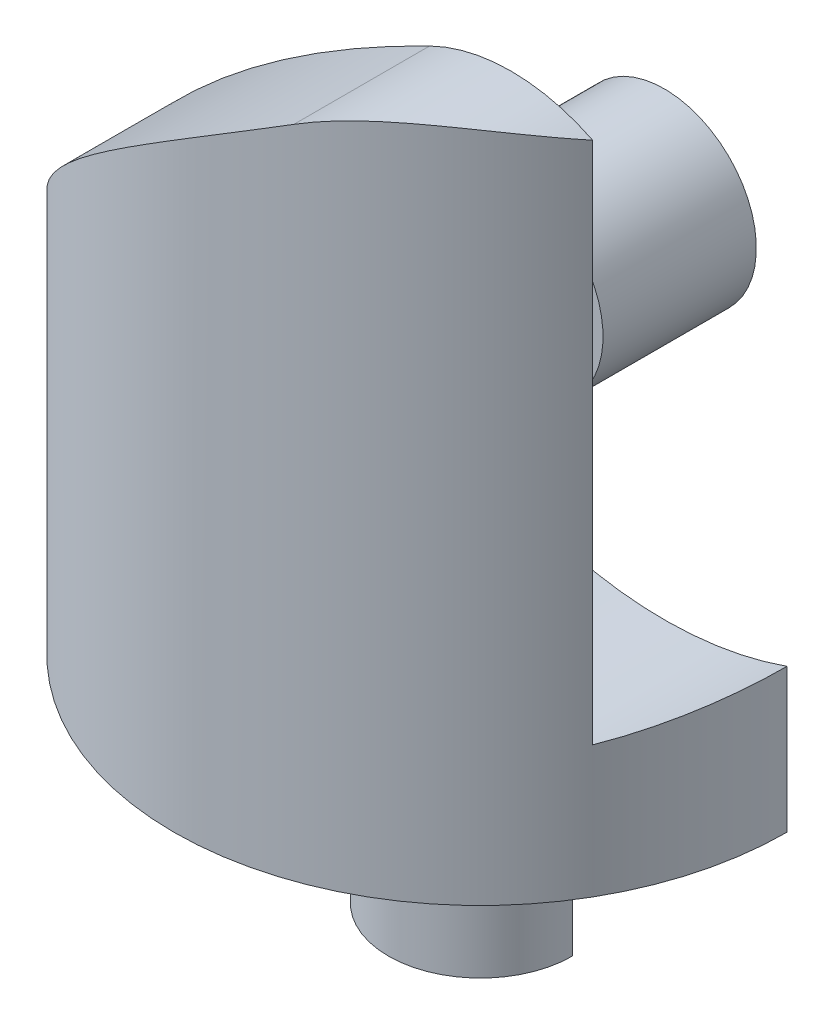
ISO-10303-21;
HEADER;
FILE_DESCRIPTION(('STEP AP214'),'2;1');
FILE_NAME('part.step','',(''),(''),'','','');
FILE_SCHEMA(('AUTOMOTIVE_DESIGN { 1 0 10303 214 1 1 1 1 }'));
ENDSEC;
DATA;
#1=APPLICATION_CONTEXT('core data for automotive mechanical design processes');
#2=APPLICATION_PROTOCOL_DEFINITION('international standard','automotive_design',2000,#1);
#3=PRODUCT_CONTEXT('',#1,'mechanical');
#4=PRODUCT('Part','Part','',(#3));
#5=PRODUCT_RELATED_PRODUCT_CATEGORY('part','',(#4));
#6=PRODUCT_DEFINITION_FORMATION('','',#4);
#7=PRODUCT_DEFINITION_CONTEXT('part definition',#1,'design');
#8=PRODUCT_DEFINITION('design','',#6,#7);
#9=PRODUCT_DEFINITION_SHAPE('','',#8);
#10=(LENGTH_UNIT() NAMED_UNIT(*) SI_UNIT(.MILLI.,.METRE.));
#11=(NAMED_UNIT(*) PLANE_ANGLE_UNIT() SI_UNIT($,.RADIAN.));
#12=(NAMED_UNIT(*) SI_UNIT($,.STERADIAN.) SOLID_ANGLE_UNIT());
#13=UNCERTAINTY_MEASURE_WITH_UNIT(LENGTH_MEASURE(1.E-05),#10,'distance_accuracy_value','');
#14=(GEOMETRIC_REPRESENTATION_CONTEXT(3) GLOBAL_UNCERTAINTY_ASSIGNED_CONTEXT((#13)) GLOBAL_UNIT_ASSIGNED_CONTEXT((#10,
#11,#12)) REPRESENTATION_CONTEXT('',''));
#15=CARTESIAN_POINT('',(0.,0.,0.));
#16=DIRECTION('',(0.,0.,1.));
#17=DIRECTION('',(1.,0.,0.));
#18=AXIS2_PLACEMENT_3D('',#15,#16,#17);
#19=CARTESIAN_POINT('',(3.,8.,2.5));
#20=DIRECTION('',(0.,0.,-1.));
#21=DIRECTION('',(-1.,0.,0.));
#22=AXIS2_PLACEMENT_3D('',#19,#20,#21);
#23=CYLINDRICAL_SURFACE('',#22,1.5);
#24=CARTESIAN_POINT('',(3.,8.,2.5));
#25=DIRECTION('',(0.,0.,-1.));
#26=DIRECTION('',(-1.,0.,0.));
#27=AXIS2_PLACEMENT_3D('',#24,#25,#26);
#28=CIRCLE('',#27,1.5);
#29=CARTESIAN_POINT('',(1.5,8.,2.5));
#30=VERTEX_POINT('',#29);
#31=EDGE_CURVE('E11',#30,#30,#28,.T.);
#32=ORIENTED_EDGE('',*,*,#31,.T.);
#33=EDGE_LOOP('',(#32));
#34=FACE_BOUND('',#33,.T.);
#35=CARTESIAN_POINT('',(3.,8.,0.));
#36=DIRECTION('',(0.,0.,-1.));
#37=DIRECTION('',(-1.,0.,0.));
#38=AXIS2_PLACEMENT_3D('',#35,#36,#37);
#39=CIRCLE('',#38,1.5);
#40=CARTESIAN_POINT('',(1.5,8.,0.));
#41=VERTEX_POINT('',#40);
#42=EDGE_CURVE('E46',#41,#41,#39,.T.);
#43=ORIENTED_EDGE('',*,*,#42,.F.);
#44=EDGE_LOOP('',(#43));
#45=FACE_BOUND('',#44,.T.);
#46=ADVANCED_FACE('F43',(#34,#45),#23,.T.);
#47=CARTESIAN_POINT('',(0.,0.,2.5));
#48=DIRECTION('',(0.,0.,-1.));
#49=DIRECTION('',(-1.,0.,0.));
#50=AXIS2_PLACEMENT_3D('',#47,#48,#49);
#51=PLANE('',#50);
#52=ORIENTED_EDGE('',*,*,#31,.F.);
#53=EDGE_LOOP('',(#52));
#54=FACE_BOUND('',#53,.T.);
#55=ADVANCED_FACE('F58',(#54),#51,.F.);
#56=CARTESIAN_POINT('',(0.,0.,0.));
#57=DIRECTION('',(0.,0.,-1.));
#58=DIRECTION('',(-1.,0.,0.));
#59=AXIS2_PLACEMENT_3D('',#56,#57,#58);
#60=PLANE('',#59);
#61=ORIENTED_EDGE('',*,*,#42,.T.);
#62=EDGE_LOOP('',(#61));
#63=FACE_BOUND('',#62,.T.);
#64=ADVANCED_FACE('F55',(#63),#60,.T.);
#65=CLOSED_SHELL('',(#46,#55,#64));
#66=MANIFOLD_SOLID_BREP('B2',#65);
#67=CARTESIAN_POINT('',(0.,13.,0.));
#68=DIRECTION('',(0.,-1.,0.));
#69=DIRECTION('',(0.,0.,-1.));
#70=AXIS2_PLACEMENT_3D('',#67,#68,#69);
#71=CYLINDRICAL_SURFACE('',#70,5.);
#72=DIRECTION('',(0.,-1.,0.));
#73=VECTOR('',#72,1.);
#74=CARTESIAN_POINT('',(5.,13.,0.));
#75=LINE('',#74,#73);
#76=CARTESIAN_POINT('',(5.,2.34314575050762,0.));
#77=VERTEX_POINT('',#76);
#78=CARTESIAN_POINT('',(5.,0.,0.));
#79=VERTEX_POINT('',#78);
#80=EDGE_CURVE('E161',#77,#79,#75,.T.);
#81=ORIENTED_EDGE('',*,*,#80,.F.);
#82=CARTESIAN_POINT('',(5.,2.34314575050762,0.));
#83=CARTESIAN_POINT('',(5.00002039225627,2.34319477496916,0.139443810256423));
#84=CARTESIAN_POINT('',(4.99416758087379,2.34108468303744,0.278873973500609));
#85=CARTESIAN_POINT('',(4.97086791866474,2.3329057170839,0.55663036928368));
#86=CARTESIAN_POINT('',(4.95342249266698,2.32683732957124,0.694956735374229));
#87=CARTESIAN_POINT('',(4.90759431227184,2.31127237597445,0.966475196461659));
#88=CARTESIAN_POINT('',(4.87945797302168,2.30185333046147,1.09971350396695));
#89=CARTESIAN_POINT('',(4.81250151889743,2.28020310971065,1.36319559053278));
#90=CARTESIAN_POINT('',(4.7736842899542,2.26797269423971,1.49344016820087));
#91=CARTESIAN_POINT('',(4.67771118320873,2.23907532192735,1.77331952057941));
#92=CARTESIAN_POINT('',(4.61851040900527,2.22200604229899,1.92221436162286));
#93=CARTESIAN_POINT('',(4.48532027336699,2.18634897994746,2.21545075160582));
#94=CARTESIAN_POINT('',(4.41114629054179,2.16774414916794,2.35970642858247));
#95=CARTESIAN_POINT('',(4.33012701892219,2.14929387906612,2.5));
#96=B_SPLINE_CURVE_WITH_KNOTS('',3,(#82,#83,#84,#85,#86,#87,#88,#89,#90,#91,#92,#93,#94,#95),
.UNSPECIFIED.,.F.,.F.,(4,2,2,2,2,2,4),(0.,0.418171607227552,0.836291827188225,1.24530808483297,
1.6542139363668,2.13687491849892,2.62589707023056),.UNSPECIFIED.);
#97=CARTESIAN_POINT('',(4.33012701892219,2.14929387906612,2.5));
#98=VERTEX_POINT('',#97);
#99=EDGE_CURVE('E149',#77,#98,#96,.T.);
#100=ORIENTED_EDGE('',*,*,#99,.T.);
#101=DIRECTION('',(0.,-1.,0.));
#102=VECTOR('',#101,1.);
#103=CARTESIAN_POINT('',(4.33012701892219,13.,2.5));
#104=LINE('',#103,#102);
#105=CARTESIAN_POINT('',(4.33012701892219,10.6890076447517,2.5));
#106=VERTEX_POINT('',#105);
#107=EDGE_CURVE('E213',#106,#98,#104,.T.);
#108=ORIENTED_EDGE('',*,*,#107,.F.);
#109=CARTESIAN_POINT('',(1.6708535335987,10.6894924559948,4.71256283451592));
#110=CARTESIAN_POINT('',(1.74242196287571,10.7248829620126,4.68720873107257));
#111=CARTESIAN_POINT('',(1.8147861971584,10.757069997054,4.65969679780792));
#112=CARTESIAN_POINT('',(1.96021884849384,10.8151286281408,4.60039699214886));
#113=CARTESIAN_POINT('',(2.03328665944464,10.841005228751,4.56861253936487));
#114=CARTESIAN_POINT('',(2.1787480423945,10.8864008474893,4.50104919409141));
#115=CARTESIAN_POINT('',(2.25114216705804,10.9059709593313,4.46530572780408));
#116=CARTESIAN_POINT('',(2.39512885651215,10.9393192698085,4.38975867511155));
#117=CARTESIAN_POINT('',(2.46672130372754,10.9530966294249,4.34995450159267));
#118=CARTESIAN_POINT('',(2.67889346074285,10.9861849077429,4.22496395418399));
#119=CARTESIAN_POINT('',(2.81739467328766,10.997408723453,4.13395694760079));
#120=CARTESIAN_POINT('',(3.08494114218228,11.0017963936416,3.93836814625793));
#121=CARTESIAN_POINT('',(3.21396557103002,10.9949216250363,3.83375777402972));
#122=CARTESIAN_POINT('',(3.42799169074389,10.9707245078831,3.6419524840707));
#123=CARTESIAN_POINT('',(3.5157038046243,10.956591407967,3.55732271560045));
#124=CARTESIAN_POINT('',(3.68417248003803,10.9222092271819,3.38254626693696));
#125=CARTESIAN_POINT('',(3.76492606768017,10.9019575478908,3.29239725584115));
#126=CARTESIAN_POINT('',(3.99654421318131,10.8342167318361,3.0142776974428));
#127=CARTESIAN_POINT('',(4.13657188798915,10.7797700523943,2.81881000926178));
#128=CARTESIAN_POINT('',(4.32575225709714,10.6921027378806,2.51058094780144));
#129=CARTESIAN_POINT('',(4.3860511042188,10.661387805057,2.40366259435049));
#130=CARTESIAN_POINT('',(4.49861237640554,10.5996688003874,2.1857551068507));
#131=CARTESIAN_POINT('',(4.55087441297414,10.5686647146406,2.07476577633331));
#132=CARTESIAN_POINT('',(4.69531787399961,10.4776657218949,1.73612480868056));
#133=CARTESIAN_POINT('',(4.77535576664966,10.4195823582431,1.50247584815679));
#134=CARTESIAN_POINT('',(4.86557584305588,10.3496490895894,1.15677751541706));
#135=CARTESIAN_POINT('',(4.88979664552301,10.3301050116841,1.04976769254739));
#136=CARTESIAN_POINT('',(4.93123893904556,10.2958745675641,0.833649431041219));
#137=CARTESIAN_POINT('',(4.9484640089609,10.2811857182411,0.72454209544245));
#138=CARTESIAN_POINT('',(4.97565767574246,10.2576763628743,0.505014261721172));
#139=CARTESIAN_POINT('',(4.98564058700548,10.2488442836926,0.394596794830878));
#140=CARTESIAN_POINT('',(4.99823761068812,10.2376593130707,0.173008819944964));
#141=CARTESIAN_POINT('',(5.00085198485178,10.2353061914859,0.0618383388384209));
#142=CARTESIAN_POINT('',(4.99866112438973,10.2372652040609,-0.160517627398674));
#143=CARTESIAN_POINT('',(4.99384595456478,10.2415862633145,-0.271702933465061));
#144=CARTESIAN_POINT('',(4.97686707882791,10.2565731403544,-0.493072593123248));
#145=CARTESIAN_POINT('',(4.96470307191527,10.2672392180258,-0.603256905527743));
#146=CARTESIAN_POINT('',(4.93318341563938,10.2941729445384,-0.822170459035592));
#147=CARTESIAN_POINT('',(4.91380969706182,10.3104546599062,-0.930895327011641));
#148=CARTESIAN_POINT('',(4.86811141396029,10.3475570096256,-1.14612643185103));
#149=CARTESIAN_POINT('',(4.84178301670703,10.3683801456513,-1.25263141030521));
#150=CARTESIAN_POINT('',(4.77327186992706,10.4203053326689,-1.49543207066222));
#151=CARTESIAN_POINT('',(4.72870357163877,10.4525981017026,-1.63080230673977));
#152=CARTESIAN_POINT('',(4.62851229126488,10.5202382775585,-1.89659210021168));
#153=CARTESIAN_POINT('',(4.5728867046973,10.5555864029419,-2.02701048258849));
#154=CARTESIAN_POINT('',(4.45082101255653,10.6268060599634,-2.28259495502331));
#155=CARTESIAN_POINT('',(4.38437812559392,10.6626777240506,-2.40775968380126));
#156=CARTESIAN_POINT('',(4.24089794282538,10.7324984140953,-2.6523403876553));
#157=CARTESIAN_POINT('',(4.16386282091189,10.7664478325508,-2.7717575355616));
#158=CARTESIAN_POINT('',(3.95338985728418,10.8477868853374,-3.06916778932224));
#159=CARTESIAN_POINT('',(3.81239667880698,10.8921623999256,-3.24283773686596));
#160=CARTESIAN_POINT('',(3.58294930881612,10.9438603633853,-3.48928148262548));
#161=CARTESIAN_POINT('',(3.50352118886234,10.9586115439858,-3.56904696144602));
#162=CARTESIAN_POINT('',(3.33894988456857,10.9819475623549,-3.72345532673425));
#163=CARTESIAN_POINT('',(3.25380838043754,10.9905342043945,-3.79809970628373));
#164=CARTESIAN_POINT('',(3.0985785999047,10.9991428194868,-3.92510264142583));
#165=CARTESIAN_POINT('',(3.02953274903558,11.0006805636173,-3.97863790780489));
#166=CARTESIAN_POINT('',(2.8887794693644,10.9987633362553,-4.08198120537099));
#167=CARTESIAN_POINT('',(2.81707267691975,10.9953095510723,-4.13179011922108));
#168=CARTESIAN_POINT('',(2.67160455283241,10.9828631674898,-4.22730207458858));
#169=CARTESIAN_POINT('',(2.59784706258932,10.9738803360199,-4.27301219376109));
#170=CARTESIAN_POINT('',(2.44881979125743,10.949898517888,-4.36013055161643));
#171=CARTESIAN_POINT('',(2.37355041129462,10.9349011074649,-4.40153991382055));
#172=CARTESIAN_POINT('',(2.19350059940515,10.8915480505114,-4.49469875579158));
#173=CARTESIAN_POINT('',(2.08833537110639,10.8602847375157,-4.54442813695999));
#174=CARTESIAN_POINT('',(1.93109297238367,10.8036703386134,-4.61239370299458));
#175=CARTESIAN_POINT('',(1.8786677584713,10.7831324977177,-4.63397747653102));
#176=CARTESIAN_POINT('',(1.77431264374476,10.7387783136907,-4.67492869888421));
#177=CARTESIAN_POINT('',(1.72238295816599,10.7149606095748,-4.69429522150773));
#178=CARTESIAN_POINT('',(1.6708535335987,10.6894924559948,-4.71256283451592));
#179=B_SPLINE_CURVE_WITH_KNOTS('',3,(#109,#110,#111,#112,#113,#114,#115,#116,#117,#118,#119,
#120,#121,#122,#123,#124,#125,#126,#127,#128,#129,#130,#131,#132,#133,#134,#135,#136,#137,#138,
#139,#140,#141,#142,#143,#144,#145,#146,#147,#148,#149,#150,#151,#152,#153,#154,#155,#156,#157,
#158,#159,#160,#161,#162,#163,#164,#165,#166,#167,#168,#169,#170,#171,#172,#173,#174,#175,#176,
#177,#178),.UNSPECIFIED.,.F.,.F.,(4,2,2,2,2,2,2,2,2,2,2,2,2,2,2,2,2,2,2,2,2,2,2,2,2,2,2,2,2,2,2,
2,2,2,4),(0.,0.251187718854084,0.502175577712232,0.751075646635195,1.00001175368973,
1.49610463836436,1.99325706231952,2.36086121886685,2.7286217085404,3.46492291230786,
3.84427861529559,4.22365265043897,4.98122852932369,5.31530398293016,5.64920831509419,
5.9824508612804,6.31568156992675,6.64935827956437,6.98304865717952,7.31758103533423,
7.65229816059793,8.09008473805032,8.52797455611713,8.96597714457917,9.40388997358811,
10.0851362279149,10.4253956028007,10.7655553480529,11.0274687266749,11.2893198680114,
11.5507097777373,11.8120312298054,12.1722806965037,12.3530672830501,12.5339291146009),.UNSPECIFIED.);
#180=CARTESIAN_POINT('',(1.6708535335987,10.6894924559948,4.71256283451592));
#181=VERTEX_POINT('',#180);
#182=EDGE_CURVE('E92',#181,#106,#179,.T.);
#183=ORIENTED_EDGE('',*,*,#182,.F.);
#184=CARTESIAN_POINT('',(1.6708535335987,10.6894924559948,4.71256283451592));
#185=CARTESIAN_POINT('',(1.52312105923024,10.6174610076223,4.76496775600533));
#186=CARTESIAN_POINT('',(1.37414172787362,10.5427145633275,4.80994483518314));
#187=CARTESIAN_POINT('',(1.07533466781926,10.388079026852,4.88541825823609));
#188=CARTESIAN_POINT('',(0.925507702132701,10.308194043038,4.9159260111532));
#189=CARTESIAN_POINT('',(0.627308679636751,10.1439478784449,4.9627764252057));
#190=CARTESIAN_POINT('',(0.478933284605676,10.059616390349,4.97920287613073));
#191=CARTESIAN_POINT('',(0.184031511903105,9.88627547370902,4.99879680705802));
#192=CARTESIAN_POINT('',(0.0375054594691944,9.79726523616251,5.00196198636718));
#193=CARTESIAN_POINT('',(-0.252029739554137,9.6151310504193,4.99573672492681));
#194=CARTESIAN_POINT('',(-0.395048561410927,9.5220210355162,4.98638604933414));
#195=CARTESIAN_POINT('',(-0.677092567366,9.33165652350841,4.95597349981255));
#196=CARTESIAN_POINT('',(-0.816116133673574,9.23440038603234,4.93490695015806));
#197=CARTESIAN_POINT('',(-1.08939460273654,9.03594625431263,4.88186588296654));
#198=CARTESIAN_POINT('',(-1.22364431907904,8.93474420911523,4.84987987939118));
#199=CARTESIAN_POINT('',(-1.48652029005129,8.7287592759393,4.77586724969204));
#200=CARTESIAN_POINT('',(-1.61514578992368,8.62397591069673,4.73383928082122));
#201=CARTESIAN_POINT('',(-1.88400673984568,8.39599277595636,4.6339935715921));
#202=CARTESIAN_POINT('',(-2.02329857277335,8.27229010336041,4.5747813484067));
#203=CARTESIAN_POINT('',(-2.29311710471441,8.02097575848433,4.44567073006689));
#204=CARTESIAN_POINT('',(-2.42364308219928,7.89336376567898,4.37577145679584));
#205=CARTESIAN_POINT('',(-2.67549390034259,7.6345814907957,4.22648417970575));
#206=CARTESIAN_POINT('',(-2.79681573106303,7.50341006358899,4.1470930935528));
#207=CARTESIAN_POINT('',(-3.02990772339057,7.23792164617656,3.97997856772649));
#208=CARTESIAN_POINT('',(-3.14167679388665,7.10360429887189,3.8922541786376));
#209=CARTESIAN_POINT('',(-3.37628999226057,6.80578264022065,3.69173280079518));
#210=CARTESIAN_POINT('',(-3.49705505371551,6.64168622136172,3.57737920083591));
#211=CARTESIAN_POINT('',(-3.7245442986743,6.31025580263444,3.3398820200529));
#212=CARTESIAN_POINT('',(-3.83127096996538,6.14292238245051,3.21674000263488));
#213=CARTESIAN_POINT('',(-4.03081982701207,5.80564367919637,2.9628658348945));
#214=CARTESIAN_POINT('',(-4.12363684635482,5.63569745137407,2.83213088925088));
#215=CARTESIAN_POINT('',(-4.29548121874399,5.29418496356084,2.56402060971969));
#216=CARTESIAN_POINT('',(-4.37451245980486,5.12261917477191,2.42664716209759));
#217=CARTESIAN_POINT('',(-4.50707749258633,4.80760417231043,2.16879003447822));
#218=CARTESIAN_POINT('',(-4.56266610159869,4.66421427475805,2.04928712078375));
#219=CARTESIAN_POINT('',(-4.63904963735928,4.45008122329931,1.86642951183136));
#220=CARTESIAN_POINT('',(-4.66331725255981,4.37895394932163,1.80495861293797));
#221=CARTESIAN_POINT('',(-4.70956835923323,4.23721488533189,1.68058514784474));
#222=CARTESIAN_POINT('',(-4.73155192594181,4.16660307841183,1.61768262888517));
#223=CARTESIAN_POINT('',(-4.78111024048729,3.99974549194951,1.46613194532066));
#224=CARTESIAN_POINT('',(-4.80766593264854,3.90387779484261,1.37672273935999));
#225=CARTESIAN_POINT('',(-4.84430699673162,3.76224430631837,1.23893390377356));
#226=CARTESIAN_POINT('',(-4.85601962733563,3.71525347834619,1.19224261126892));
#227=CARTESIAN_POINT('',(-4.87832317690779,3.6224750151501,1.09742334075172));
#228=CARTESIAN_POINT('',(-4.88891425602072,3.57668720885234,1.04929556911344));
#229=CARTESIAN_POINT('',(-4.90908099092754,3.48621902982315,0.950526841340941));
#230=CARTESIAN_POINT('',(-4.91864052335813,3.44156282927628,0.899860284243049));
#231=CARTESIAN_POINT('',(-4.93651736155418,3.35485844351674,0.795976698237921));
#232=CARTESIAN_POINT('',(-4.9448329559659,3.31281389693562,0.742756286328587));
#233=CARTESIAN_POINT('',(-4.96000814962332,3.23325107810766,0.633515042327318));
#234=CARTESIAN_POINT('',(-4.96687980959278,3.19569654315079,0.577522667452517));
#235=CARTESIAN_POINT('',(-4.97900099480595,3.12729497130634,0.461445635726567));
#236=CARTESIAN_POINT('',(-4.98425583070768,3.0964260757265,0.401375185007013));
#237=CARTESIAN_POINT('',(-4.99015401617469,3.06097913520459,0.314582310330482));
#238=CARTESIAN_POINT('',(-4.9916588530265,3.05182593541255,0.289785095483828));
#239=CARTESIAN_POINT('',(-4.99432308418654,3.03549304608371,0.239520817623864));
#240=CARTESIAN_POINT('',(-4.995482472154,3.02831339277181,0.21405374232451));
#241=CARTESIAN_POINT('',(-4.99741967100607,3.01625074011705,0.162651404368038));
#242=CARTESIAN_POINT('',(-4.99819875896697,3.01136005655163,0.13671801614301));
#243=CARTESIAN_POINT('',(-4.99935419773079,3.00408726131459,0.0844942762320898));
#244=CARTESIAN_POINT('',(-4.99973065183105,3.00170450622632,0.0582040178563475));
#245=CARTESIAN_POINT('',(-5.00006752579177,2.99957290170381,0.00532895089124505));
#246=CARTESIAN_POINT('',(-5.00002503224276,2.99984249698754,-0.0212566342974153));
#247=CARTESIAN_POINT('',(-4.99951875264534,3.00304418720498,-0.0742634901851573));
#248=CARTESIAN_POINT('',(-4.99905491001536,3.00597663972497,-0.100684738336169));
#249=CARTESIAN_POINT('',(-4.99772187817379,3.01435184760099,-0.153192899124878));
#250=CARTESIAN_POINT('',(-4.99685146710633,3.01980216933682,-0.179278558716427));
#251=CARTESIAN_POINT('',(-4.99473493816977,3.03294272623987,-0.230844722270373));
#252=CARTESIAN_POINT('',(-4.99348891483428,3.04063239779394,-0.256325376761003));
#253=CARTESIAN_POINT('',(-4.98815044614817,3.07321929989341,-0.351007064518568));
#254=CARTESIAN_POINT('',(-4.98291682135684,3.10452569315509,-0.417963469300599));
#255=CARTESIAN_POINT('',(-4.97356650796554,3.15807053086239,-0.514484260444487));
#256=CARTESIAN_POINT('',(-4.9701865089076,3.1770878887346,-0.546100393889708));
#257=CARTESIAN_POINT('',(-4.96297110152747,3.21683955934711,-0.608187216927154));
#258=CARTESIAN_POINT('',(-4.95913584118369,3.23757331352942,-0.638658274498758));
#259=CARTESIAN_POINT('',(-4.95028507330456,3.28439284839722,-0.704252892695873));
#260=CARTESIAN_POINT('',(-4.94518345389169,3.31074994240385,-0.739168455139946));
#261=CARTESIAN_POINT('',(-4.934432722339,3.36485433681138,-0.80782353266701));
#262=CARTESIAN_POINT('',(-4.92878348791964,3.39260194703598,-0.841562782788287));
#263=CARTESIAN_POINT('',(-4.91108191274076,3.47729251578818,-0.941185763867741));
#264=CARTESIAN_POINT('',(-4.89825673741087,3.53578512683687,-1.00561170173652));
#265=CARTESIAN_POINT('',(-4.8706706904985,3.65520932834472,-1.13168961231975));
#266=CARTESIAN_POINT('',(-4.85590970455226,3.71614106275445,-1.19334142085503));
#267=CARTESIAN_POINT('',(-4.82440710428785,3.83991014102089,-1.31493818878576));
#268=CARTESIAN_POINT('',(-4.80765430800655,3.9027566135631,-1.37487091807803));
#269=CARTESIAN_POINT('',(-4.772264159905,4.02941326961111,-1.49308343129892));
#270=CARTESIAN_POINT('',(-4.75362751085286,4.09322308624167,-1.55136382131664));
#271=CARTESIAN_POINT('',(-4.71446506158494,4.22147016020429,-1.66658941630516));
#272=CARTESIAN_POINT('',(-4.69393913390823,4.28590745960711,-1.7235345308654));
#273=CARTESIAN_POINT('',(-4.64037265665858,4.44711113128249,-1.86415501483122));
#274=CARTESIAN_POINT('',(-4.60616277801559,4.54410759817495,-1.94712391550649));
#275=CARTESIAN_POINT('',(-4.53346738697697,4.73837787830314,-2.11085100461733));
#276=CARTESIAN_POINT('',(-4.49498139857901,4.8356517212388,-2.19160894568658));
#277=CARTESIAN_POINT('',(-4.4136717315959,5.03014371857624,-2.35106641213642));
#278=CARTESIAN_POINT('',(-4.37084646796996,5.12736183948897,-2.4297651720405));
#279=CARTESIAN_POINT('',(-4.28082315025451,5.32144399511232,-2.58507408936179));
#280=CARTESIAN_POINT('',(-4.2336247967558,5.41830800510564,-2.66168410330488));
#281=CARTESIAN_POINT('',(-4.08569105992303,5.7074856291277,-2.88782422502765));
#282=CARTESIAN_POINT('',(-3.97836604903805,5.89898907930919,-3.03415821525048));
#283=CARTESIAN_POINT('',(-3.74592918687215,6.27845055283004,-3.31684667540895));
#284=CARTESIAN_POINT('',(-3.62082225873098,6.4664095412364,-3.45320389176005));
#285=CARTESIAN_POINT('',(-3.36895044826123,6.81542828294305,-3.69827062474948));
#286=CARTESIAN_POINT('',(-3.24420709841849,6.97699719189914,-3.80833089856387));
#287=CARTESIAN_POINT('',(-2.98108934394366,7.29604669416679,-4.01763129176078));
#288=CARTESIAN_POINT('',(-2.8427144989321,7.45352715518903,-4.11687106135741));
#289=CARTESIAN_POINT('',(-2.55273547121045,7.76376828433281,-4.30269660092536));
#290=CARTESIAN_POINT('',(-2.4011301430632,7.91652854224653,-4.38928127353473));
#291=CARTESIAN_POINT('',(-2.08541661905396,8.21665136710888,-4.54777071003936));
#292=CARTESIAN_POINT('',(-1.92131092195777,8.36401500414143,-4.61967839727653));
#293=CARTESIAN_POINT('',(-1.61132773406425,8.62747917789242,-4.73561228188657));
#294=CARTESIAN_POINT('',(-1.46726895827105,8.74454658613167,-4.7823143686123));
#295=CARTESIAN_POINT('',(-1.17218929652525,8.97416982807314,-4.86306069543297));
#296=CARTESIAN_POINT('',(-1.02116976003399,9.08672652840829,-4.89710737748761));
#297=CARTESIAN_POINT('',(-0.713503629870567,9.30672872038053,-4.95128885397821));
#298=CARTESIAN_POINT('',(-0.556869431506608,9.41418438431004,-4.97145252072767));
#299=CARTESIAN_POINT('',(-0.238939192955283,9.62384943877476,-4.99683161629182));
#300=CARTESIAN_POINT('',(-0.0776438182336992,9.7260595724752,-5.00204916838435));
#301=CARTESIAN_POINT('',(0.215477353533416,9.90495234656458,-4.99705390396718));
#302=CARTESIAN_POINT('',(0.346738783611819,9.98264924544945,-4.98972091907755));
#303=CARTESIAN_POINT('',(0.610379938125381,10.1342592859775,-4.9643698859173));
#304=CARTESIAN_POINT('',(0.742759352016925,10.2081734405349,-4.9463547144752));
#305=CARTESIAN_POINT('',(1.00832673720487,10.3524040717701,-4.89913652710036));
#306=CARTESIAN_POINT('',(1.14151557305773,10.4227018951227,-4.86988104024342));
#307=CARTESIAN_POINT('',(1.4070856099724,10.5592144550896,-4.79989827884084));
#308=CARTESIAN_POINT('',(1.53946618926107,10.6254263362935,-4.75916309007888));
#309=CARTESIAN_POINT('',(1.6708535335987,10.6894924559948,-4.71256283451592));
#310=B_SPLINE_CURVE_WITH_KNOTS('',3,(#184,#185,#186,#187,#188,#189,#190,#191,#192,#193,#194,
#195,#196,#197,#198,#199,#200,#201,#202,#203,#204,#205,#206,#207,#208,#209,#210,#211,#212,#213,
#214,#215,#216,#217,#218,#219,#220,#221,#222,#223,#224,#225,#226,#227,#228,#229,#230,#231,#232,
#233,#234,#235,#236,#237,#238,#239,#240,#241,#242,#243,#244,#245,#246,#247,#248,#249,#250,#251,
#252,#253,#254,#255,#256,#257,#258,#259,#260,#261,#262,#263,#264,#265,#266,#267,#268,#269,#270,
#271,#272,#273,#274,#275,#276,#277,#278,#279,#280,#281,#282,#283,#284,#285,#286,#287,#288,#289,
#290,#291,#292,#293,#294,#295,#296,#297,#298,#299,#300,#301,#302,#303,#304,#305,#306,#307,#308,
#309),.UNSPECIFIED.,.F.,.F.,(4,2,2,2,2,2,2,2,2,2,2,2,2,2,2,2,2,2,2,2,2,2,2,2,2,2,2,2,2,2,2,2,2,
2,2,2,2,2,2,2,2,2,2,2,2,2,2,2,2,2,2,2,2,2,2,2,2,2,2,2,2,2,4),(0.,0.51726705961071,
1.03412557404333,1.54788677591354,2.06173710633425,2.57395870960898,3.08638488388918,
3.59935174230185,4.11238722976787,4.69824545013474,5.2841518342698,5.87024900277949,
6.45641302577091,7.15667478341593,7.85681227780342,8.55720918067179,9.25740822951653,
9.84139849992726,10.1326379876484,10.4238678790067,10.8249558005762,11.0267436251363,
11.2285025977327,11.4330602697719,11.6378968247895,11.8409477127821,12.0433243542435,
12.1226818682415,12.2020408387676,12.2811314504677,12.3602017662824,12.4398223317492,
12.5194535907797,12.5993257199127,12.6791777636918,12.9000258630092,13.0111635905232,
13.1222652921735,13.2543468285278,13.3864579262282,13.650166068557,13.913889797251,
14.1791709684182,14.4443535395749,14.7095540145109,15.1058941224091,15.5022783938555,
15.8988079812381,16.2953647376166,17.0860251564651,17.8764670962407,18.5715325113772,
19.2666203886858,19.961768503465,20.6567780241857,21.2304642948908,21.8040398107894,
22.3764188370594,22.9487165458756,23.4064491963556,23.864058630428,24.3238307076365,
24.7839205348087),.UNSPECIFIED.);
#311=CARTESIAN_POINT('',(-4.3301270189222,5.21513455120984,2.5));
#312=VERTEX_POINT('',#311);
#313=EDGE_CURVE('E195',#181,#312,#310,.T.);
#314=ORIENTED_EDGE('',*,*,#313,.T.);
#315=DIRECTION('',(0.,-1.,0.));
#316=VECTOR('',#315,1.);
#317=CARTESIAN_POINT('',(-4.33012701892219,13.,2.5));
#318=LINE('',#317,#316);
#319=CARTESIAN_POINT('',(-4.33012701892219,3.,2.5));
#320=VERTEX_POINT('',#319);
#321=EDGE_CURVE('E215',#320,#312,#318,.F.);
#322=ORIENTED_EDGE('',*,*,#321,.F.);
#323=CARTESIAN_POINT('',(0.,3.,0.));
#324=DIRECTION('',(0.,1.,0.));
#325=DIRECTION('',(0.,0.,1.));
#326=AXIS2_PLACEMENT_3D('',#323,#324,#325);
#327=CIRCLE('',#326,5.);
#328=CARTESIAN_POINT('',(-4.99999999999999,3.00000000000005,0.));
#329=VERTEX_POINT('',#328);
#330=EDGE_CURVE('E217',#329,#320,#327,.T.);
#331=ORIENTED_EDGE('',*,*,#330,.F.);
#332=DIRECTION('',(0.,-1.,0.));
#333=VECTOR('',#332,1.);
#334=CARTESIAN_POINT('',(-5.,13.,0.));
#335=LINE('',#334,#333);
#336=CARTESIAN_POINT('',(-5.,0.,0.));
#337=VERTEX_POINT('',#336);
#338=EDGE_CURVE('E214',#337,#329,#335,.F.);
#339=ORIENTED_EDGE('',*,*,#338,.F.);
#340=CARTESIAN_POINT('',(0.,0.,0.));
#341=DIRECTION('',(0.,1.,0.));
#342=DIRECTION('',(0.,0.,1.));
#343=AXIS2_PLACEMENT_3D('',#340,#341,#342);
#344=CIRCLE('',#343,5.);
#345=EDGE_CURVE('E168',#337,#79,#344,.T.);
#346=ORIENTED_EDGE('',*,*,#345,.T.);
#347=EDGE_LOOP('',(#81,#100,#108,#183,#314,#322,#331,#339,#346));
#348=FACE_BOUND('',#347,.T.);
#349=ADVANCED_FACE('F84',(#348),#71,.T.);
#350=CARTESIAN_POINT('',(3.,8.,-5.));
#351=DIRECTION('',(0.,0.,1.));
#352=DIRECTION('',(1.,0.,0.));
#353=AXIS2_PLACEMENT_3D('',#350,#351,#352);
#354=CYLINDRICAL_SURFACE('',#353,3.);
#355=ORIENTED_EDGE('',*,*,#182,.T.);
#356=CARTESIAN_POINT('',(3.,8.,2.5));
#357=DIRECTION('',(0.,0.,-1.));
#358=DIRECTION('',(-1.,0.,0.));
#359=AXIS2_PLACEMENT_3D('',#356,#357,#358);
#360=CIRCLE('',#359,3.);
#361=CARTESIAN_POINT('',(1.6708535335987,10.6894924559948,2.5));
#362=VERTEX_POINT('',#361);
#363=EDGE_CURVE('E209',#362,#106,#360,.T.);
#364=ORIENTED_EDGE('',*,*,#363,.F.);
#365=DIRECTION('',(0.,0.,1.));
#366=VECTOR('',#365,1.);
#367=CARTESIAN_POINT('',(1.6708535335987,10.6894924559948,-5.));
#368=LINE('',#367,#366);
#369=EDGE_CURVE('E169',#362,#181,#368,.T.);
#370=ORIENTED_EDGE('',*,*,#369,.T.);
#371=EDGE_LOOP('',(#355,#364,#370));
#372=FACE_BOUND('',#371,.T.);
#373=ADVANCED_FACE('F189',(#372),#354,.T.);
#374=CARTESIAN_POINT('',(-5.,0.,-5.));
#375=CARTESIAN_POINT('',(-5.98295330781447,6.95685599751194,-5.));
#376=CARTESIAN_POINT('',(1.6708535335987,10.6894924559948,-5.));
#377=B_SPLINE_CURVE_WITH_KNOTS('',2,(#374,#375,#376),.UNSPECIFIED.,.F.,.F.,(3,3),(0.,1.),.UNSPECIFIED.);
#378=DIRECTION('',(0.,0.,1.));
#379=VECTOR('',#378,1.);
#380=SURFACE_OF_LINEAR_EXTRUSION('',#377,#379);
#381=CARTESIAN_POINT('',(-5.,0.,2.5));
#382=CARTESIAN_POINT('',(-5.98295330781447,6.95685599751194,2.5));
#383=CARTESIAN_POINT('',(1.6708535335987,10.6894924559948,2.5));
#384=B_SPLINE_CURVE_WITH_KNOTS('',2,(#381,#382,#383),.UNSPECIFIED.,.F.,.F.,(3,3),(0.,1.),.UNSPECIFIED.);
#385=EDGE_CURVE('E225',#312,#362,#384,.T.);
#386=ORIENTED_EDGE('',*,*,#385,.F.);
#387=ORIENTED_EDGE('',*,*,#313,.F.);
#388=ORIENTED_EDGE('',*,*,#369,.F.);
#389=EDGE_LOOP('',(#386,#387,#388));
#390=FACE_BOUND('',#389,.T.);
#391=ADVANCED_FACE('F185',(#390),#380,.F.);
#392=CARTESIAN_POINT('',(0.,-1.2E-05,0.));
#393=DIRECTION('',(0.,0.,-1.));
#394=DIRECTION('',(-1.,0.,0.));
#395=AXIS2_PLACEMENT_3D('',#392,#393,#394);
#396=PLANE('',#395);
#397=CARTESIAN_POINT('',(3.,8.,0.));
#398=DIRECTION('',(0.,0.,-1.));
#399=DIRECTION('',(-1.,0.,0.));
#400=AXIS2_PLACEMENT_3D('',#397,#398,#399);
#401=CIRCLE('',#400,6.);
#402=CARTESIAN_POINT('',(-0.3166247903554,3.,0.));
#403=VERTEX_POINT('',#402);
#404=EDGE_CURVE('E152',#77,#403,#401,.T.);
#405=ORIENTED_EDGE('',*,*,#404,.F.);
#406=ORIENTED_EDGE('',*,*,#80,.T.);
#407=DIRECTION('',(-1.,0.,0.));
#408=VECTOR('',#407,1.);
#409=CARTESIAN_POINT('',(0.,0.,0.));
#410=LINE('',#409,#408);
#411=CARTESIAN_POINT('',(1.5,0.,0.));
#412=VERTEX_POINT('',#411);
#413=EDGE_CURVE('E170',#79,#412,#410,.T.);
#414=ORIENTED_EDGE('',*,*,#413,.T.);
#415=DIRECTION('',(0.,1.,0.));
#416=VECTOR('',#415,1.);
#417=CARTESIAN_POINT('',(1.5,-3.5,0.));
#418=LINE('',#417,#416);
#419=CARTESIAN_POINT('',(1.5,-3.5,0.));
#420=VERTEX_POINT('',#419);
#421=EDGE_CURVE('E223',#420,#412,#418,.T.);
#422=ORIENTED_EDGE('',*,*,#421,.F.);
#423=DIRECTION('',(1.,0.,0.));
#424=VECTOR('',#423,1.);
#425=CARTESIAN_POINT('',(0.,-3.5,0.));
#426=LINE('',#425,#424);
#427=CARTESIAN_POINT('',(-1.5,-3.5,0.));
#428=VERTEX_POINT('',#427);
#429=EDGE_CURVE('E241',#428,#420,#426,.T.);
#430=ORIENTED_EDGE('',*,*,#429,.F.);
#431=DIRECTION('',(0.,1.,0.));
#432=VECTOR('',#431,1.);
#433=CARTESIAN_POINT('',(-1.5,-3.5,0.));
#434=LINE('',#433,#432);
#435=CARTESIAN_POINT('',(-1.5,0.,0.));
#436=VERTEX_POINT('',#435);
#437=EDGE_CURVE('E236',#428,#436,#434,.T.);
#438=ORIENTED_EDGE('',*,*,#437,.T.);
#439=EDGE_CURVE('E173',#436,#337,#410,.T.);
#440=ORIENTED_EDGE('',*,*,#439,.T.);
#441=ORIENTED_EDGE('',*,*,#338,.T.);
#442=DIRECTION('',(1.,0.,0.));
#443=VECTOR('',#442,1.);
#444=CARTESIAN_POINT('',(0.,3.,0.));
#445=LINE('',#444,#443);
#446=EDGE_CURVE('E163',#329,#403,#445,.T.);
#447=ORIENTED_EDGE('',*,*,#446,.T.);
#448=EDGE_LOOP('',(#405,#406,#414,#422,#430,#438,#440,#441,#447));
#449=FACE_BOUND('',#448,.T.);
#450=ADVANCED_FACE('F160',(#449),#396,.T.);
#451=CARTESIAN_POINT('',(0.,0.,0.));
#452=DIRECTION('',(0.,1.,0.));
#453=DIRECTION('',(0.,0.,1.));
#454=AXIS2_PLACEMENT_3D('',#451,#452,#453);
#455=PLANE('',#454);
#456=CARTESIAN_POINT('',(0.,0.,0.));
#457=DIRECTION('',(0.,-1.,0.));
#458=DIRECTION('',(0.,0.,-1.));
#459=AXIS2_PLACEMENT_3D('',#456,#457,#458);
#460=CIRCLE('',#459,1.5);
#461=EDGE_CURVE('E106',#412,#436,#460,.T.);
#462=ORIENTED_EDGE('',*,*,#461,.F.);
#463=ORIENTED_EDGE('',*,*,#413,.F.);
#464=ORIENTED_EDGE('',*,*,#345,.F.);
#465=ORIENTED_EDGE('',*,*,#439,.F.);
#466=EDGE_LOOP('',(#462,#463,#464,#465));
#467=FACE_BOUND('',#466,.T.);
#468=ADVANCED_FACE('F193',(#467),#455,.F.);
#469=CARTESIAN_POINT('',(0.,0.,2.5));
#470=DIRECTION('',(0.,0.,-1.));
#471=DIRECTION('',(-1.,0.,0.));
#472=AXIS2_PLACEMENT_3D('',#469,#470,#471);
#473=PLANE('',#472);
#474=ORIENTED_EDGE('',*,*,#385,.T.);
#475=ORIENTED_EDGE('',*,*,#363,.T.);
#476=ORIENTED_EDGE('',*,*,#107,.T.);
#477=CARTESIAN_POINT('',(3.,8.,2.5));
#478=DIRECTION('',(0.,0.,-1.));
#479=DIRECTION('',(-1.,0.,0.));
#480=AXIS2_PLACEMENT_3D('',#477,#478,#479);
#481=CIRCLE('',#480,6.);
#482=CARTESIAN_POINT('',(-0.3166247903554,3.,2.5));
#483=VERTEX_POINT('',#482);
#484=EDGE_CURVE('E99',#98,#483,#481,.T.);
#485=ORIENTED_EDGE('',*,*,#484,.T.);
#486=DIRECTION('',(1.,0.,0.));
#487=VECTOR('',#486,1.);
#488=CARTESIAN_POINT('',(0.,3.,2.5));
#489=LINE('',#488,#487);
#490=EDGE_CURVE('E222',#320,#483,#489,.T.);
#491=ORIENTED_EDGE('',*,*,#490,.F.);
#492=ORIENTED_EDGE('',*,*,#321,.T.);
#493=EDGE_LOOP('',(#474,#475,#476,#485,#491,#492));
#494=FACE_BOUND('',#493,.T.);
#495=ADVANCED_FACE('F262',(#494),#473,.T.);
#496=CARTESIAN_POINT('',(0.,3.,2.5));
#497=DIRECTION('',(0.,1.,0.));
#498=DIRECTION('',(0.,0.,1.));
#499=AXIS2_PLACEMENT_3D('',#496,#497,#498);
#500=PLANE('',#499);
#501=DIRECTION('',(0.,0.,-1.));
#502=VECTOR('',#501,1.);
#503=CARTESIAN_POINT('',(-0.3166247903554,3.,2.5));
#504=LINE('',#503,#502);
#505=EDGE_CURVE('E41',#403,#483,#504,.F.);
#506=ORIENTED_EDGE('',*,*,#505,.F.);
#507=ORIENTED_EDGE('',*,*,#446,.F.);
#508=ORIENTED_EDGE('',*,*,#330,.T.);
#509=ORIENTED_EDGE('',*,*,#490,.T.);
#510=EDGE_LOOP('',(#506,#507,#508,#509));
#511=FACE_BOUND('',#510,.T.);
#512=ADVANCED_FACE('F260',(#511),#500,.T.);
#513=CARTESIAN_POINT('',(0.,-3.5,0.));
#514=DIRECTION('',(0.,1.,0.));
#515=DIRECTION('',(0.,0.,1.));
#516=AXIS2_PLACEMENT_3D('',#513,#514,#515);
#517=CYLINDRICAL_SURFACE('',#516,1.5);
#518=ORIENTED_EDGE('',*,*,#461,.T.);
#519=ORIENTED_EDGE('',*,*,#437,.F.);
#520=CARTESIAN_POINT('',(0.,-3.5,0.));
#521=DIRECTION('',(0.,-1.,0.));
#522=DIRECTION('',(0.,0.,-1.));
#523=AXIS2_PLACEMENT_3D('',#520,#521,#522);
#524=CIRCLE('',#523,1.5);
#525=EDGE_CURVE('E239',#420,#428,#524,.T.);
#526=ORIENTED_EDGE('',*,*,#525,.F.);
#527=ORIENTED_EDGE('',*,*,#421,.T.);
#528=EDGE_LOOP('',(#518,#519,#526,#527));
#529=FACE_BOUND('',#528,.T.);
#530=ADVANCED_FACE('F256',(#529),#517,.T.);
#531=CARTESIAN_POINT('',(0.,-3.5,0.));
#532=DIRECTION('',(0.,-1.,0.));
#533=DIRECTION('',(0.,0.,-1.));
#534=AXIS2_PLACEMENT_3D('',#531,#532,#533);
#535=PLANE('',#534);
#536=ORIENTED_EDGE('',*,*,#429,.T.);
#537=ORIENTED_EDGE('',*,*,#525,.T.);
#538=EDGE_LOOP('',(#536,#537));
#539=FACE_BOUND('',#538,.T.);
#540=ADVANCED_FACE('F253',(#539),#535,.T.);
#541=CARTESIAN_POINT('',(3.,8.,2.5));
#542=DIRECTION('',(0.,0.,-1.));
#543=DIRECTION('',(-1.,0.,0.));
#544=AXIS2_PLACEMENT_3D('',#541,#542,#543);
#545=CYLINDRICAL_SURFACE('',#544,6.);
#546=ORIENTED_EDGE('',*,*,#404,.T.);
#547=ORIENTED_EDGE('',*,*,#505,.T.);
#548=ORIENTED_EDGE('',*,*,#484,.F.);
#549=ORIENTED_EDGE('',*,*,#99,.F.);
#550=EDGE_LOOP('',(#546,#547,#548,#549));
#551=FACE_BOUND('',#550,.T.);
#552=ADVANCED_FACE('F151',(#551),#545,.F.);
#553=CLOSED_SHELL('',(#349,#373,#391,#450,#468,#495,#512,#530,#540,#552));
#554=MANIFOLD_SOLID_BREP('B6',#553);
#555=ADVANCED_BREP_SHAPE_REPRESENTATION('',(#18,#66,#554),#14);
#556=SHAPE_DEFINITION_REPRESENTATION(#9,#555);
ENDSEC;
END-ISO-10303-21;
